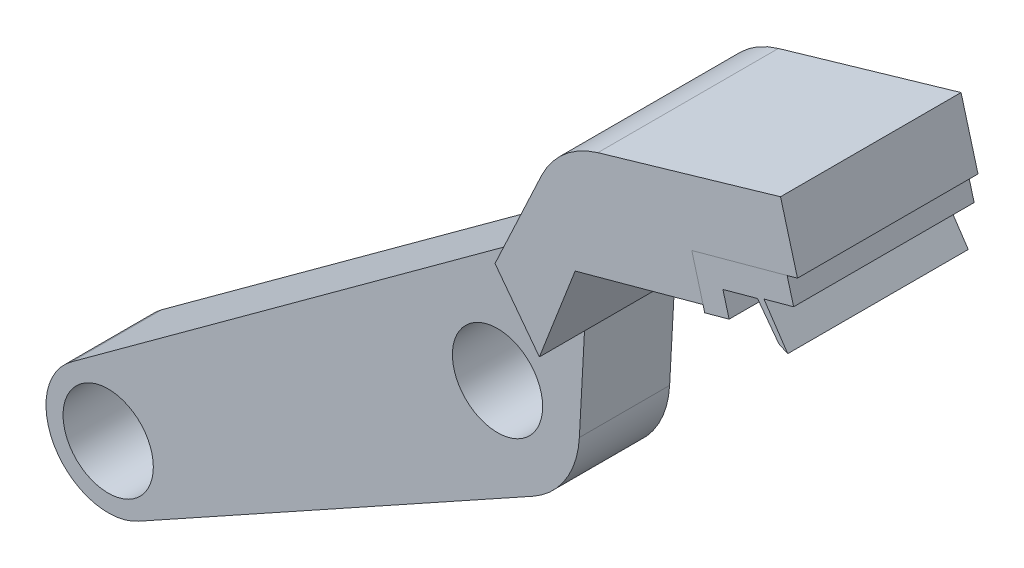
ISO-10303-21;
HEADER;
FILE_DESCRIPTION(('STEP AP214'),'2;1');
FILE_NAME('part.step','',(''),(''),'','','');
FILE_SCHEMA(('AUTOMOTIVE_DESIGN { 1 0 10303 214 1 1 1 1 }'));
ENDSEC;
DATA;
#1=APPLICATION_CONTEXT('core data for automotive mechanical design processes');
#2=APPLICATION_PROTOCOL_DEFINITION('international standard','automotive_design',2000,#1);
#3=PRODUCT_CONTEXT('',#1,'mechanical');
#4=PRODUCT('Part','Part','',(#3));
#5=PRODUCT_RELATED_PRODUCT_CATEGORY('part','',(#4));
#6=PRODUCT_DEFINITION_FORMATION('','',#4);
#7=PRODUCT_DEFINITION_CONTEXT('part definition',#1,'design');
#8=PRODUCT_DEFINITION('design','',#6,#7);
#9=PRODUCT_DEFINITION_SHAPE('','',#8);
#10=(LENGTH_UNIT() NAMED_UNIT(*) SI_UNIT(.MILLI.,.METRE.));
#11=(NAMED_UNIT(*) PLANE_ANGLE_UNIT() SI_UNIT($,.RADIAN.));
#12=(NAMED_UNIT(*) SI_UNIT($,.STERADIAN.) SOLID_ANGLE_UNIT());
#13=UNCERTAINTY_MEASURE_WITH_UNIT(LENGTH_MEASURE(1.E-05),#10,'distance_accuracy_value','');
#14=(GEOMETRIC_REPRESENTATION_CONTEXT(3) GLOBAL_UNCERTAINTY_ASSIGNED_CONTEXT((#13)) GLOBAL_UNIT_ASSIGNED_CONTEXT((#10,
#11,#12)) REPRESENTATION_CONTEXT('',''));
#15=CARTESIAN_POINT('',(0.,0.,0.));
#16=DIRECTION('',(0.,0.,1.));
#17=DIRECTION('',(1.,0.,0.));
#18=AXIS2_PLACEMENT_3D('',#15,#16,#17);
#19=CARTESIAN_POINT('',(30.6585603657704,23.7178886659538,15.));
#20=DIRECTION('',(-0.263369328323168,0.964695079752459,0.));
#21=DIRECTION('',(-0.964695079752459,-0.263369328323168,0.));
#22=AXIS2_PLACEMENT_3D('',#19,#20,#21);
#23=PLANE('',#22);
#24=DIRECTION('',(0.964695079752459,0.263369328323168,0.));
#25=VECTOR('',#24,1.);
#26=CARTESIAN_POINT('',(30.6585603657704,23.7178886659538,-5.));
#27=LINE('',#26,#25);
#28=CARTESIAN_POINT('',(27.9594920241696,22.9810218246632,-5.));
#29=VERTEX_POINT('',#28);
#30=CARTESIAN_POINT('',(30.6585603657704,23.7178886659538,-5.));
#31=VERTEX_POINT('',#30);
#32=EDGE_CURVE('E153',#29,#31,#27,.T.);
#33=ORIENTED_EDGE('',*,*,#32,.T.);
#34=DIRECTION('',(0.,0.,-1.));
#35=VECTOR('',#34,1.);
#36=CARTESIAN_POINT('',(30.6585603657704,23.7178886659538,15.));
#37=LINE('',#36,#35);
#38=CARTESIAN_POINT('',(30.6585603657704,23.7178886659538,15.));
#39=VERTEX_POINT('',#38);
#40=EDGE_CURVE('E12',#39,#31,#37,.T.);
#41=ORIENTED_EDGE('',*,*,#40,.F.);
#42=DIRECTION('',(0.964695079752459,0.263369328323168,0.));
#43=VECTOR('',#42,1.);
#44=CARTESIAN_POINT('',(30.6585603657704,23.7178886659538,15.));
#45=LINE('',#44,#43);
#46=CARTESIAN_POINT('',(27.9594920241696,22.9810218246632,15.));
#47=VERTEX_POINT('',#46);
#48=EDGE_CURVE('E171',#47,#39,#45,.T.);
#49=ORIENTED_EDGE('',*,*,#48,.F.);
#50=DIRECTION('',(0.,0.,-1.));
#51=VECTOR('',#50,1.);
#52=CARTESIAN_POINT('',(27.9594920241696,22.9810218246632,15.));
#53=LINE('',#52,#51);
#54=EDGE_CURVE('E149',#47,#29,#53,.T.);
#55=ORIENTED_EDGE('',*,*,#54,.T.);
#56=EDGE_LOOP('',(#33,#41,#49,#55));
#57=FACE_BOUND('',#56,.T.);
#58=ADVANCED_FACE('F45',(#57),#23,.F.);
#59=CARTESIAN_POINT('',(29.9720191178026,26.2326194745047,15.));
#60=DIRECTION('',(-0.964695079752459,-0.263369328323169,0.));
#61=DIRECTION('',(0.263369328323169,-0.964695079752459,0.));
#62=AXIS2_PLACEMENT_3D('',#59,#60,#61);
#63=PLANE('',#62);
#64=DIRECTION('',(-0.263369328323169,0.964695079752459,0.));
#65=VECTOR('',#64,1.);
#66=CARTESIAN_POINT('',(29.9720191178026,26.2326194745047,-5.));
#67=LINE('',#66,#65);
#68=CARTESIAN_POINT('',(29.9720191178026,26.2326194745047,-5.));
#69=VERTEX_POINT('',#68);
#70=EDGE_CURVE('E156',#31,#69,#67,.T.);
#71=ORIENTED_EDGE('',*,*,#70,.T.);
#72=DIRECTION('',(0.,0.,-1.));
#73=VECTOR('',#72,1.);
#74=CARTESIAN_POINT('',(29.9720191178026,26.2326194745047,15.));
#75=LINE('',#74,#73);
#76=CARTESIAN_POINT('',(29.9720191178026,26.2326194745047,15.));
#77=VERTEX_POINT('',#76);
#78=EDGE_CURVE('E53',#77,#69,#75,.T.);
#79=ORIENTED_EDGE('',*,*,#78,.F.);
#80=DIRECTION('',(-0.263369328323169,0.964695079752459,0.));
#81=VECTOR('',#80,1.);
#82=CARTESIAN_POINT('',(29.9720191178026,26.2326194745047,15.));
#83=LINE('',#82,#81);
#84=EDGE_CURVE('E110',#39,#77,#83,.T.);
#85=ORIENTED_EDGE('',*,*,#84,.F.);
#86=ORIENTED_EDGE('',*,*,#40,.T.);
#87=EDGE_LOOP('',(#71,#79,#85,#86));
#88=FACE_BOUND('',#87,.T.);
#89=ADVANCED_FACE('F220',(#88),#63,.F.);
#90=CARTESIAN_POINT('',(33.805939355266,27.2793097904171,15.));
#91=DIRECTION('',(-0.263369328323168,0.964695079752459,0.));
#92=DIRECTION('',(-0.964695079752459,-0.263369328323168,0.));
#93=AXIS2_PLACEMENT_3D('',#90,#91,#92);
#94=PLANE('',#93);
#95=DIRECTION('',(0.964695079752459,0.263369328323168,0.));
#96=VECTOR('',#95,1.);
#97=CARTESIAN_POINT('',(33.805939355266,27.2793097904171,-5.));
#98=LINE('',#97,#96);
#99=CARTESIAN_POINT('',(33.805939355266,27.2793097904171,-5.));
#100=VERTEX_POINT('',#99);
#101=EDGE_CURVE('E158',#69,#100,#98,.T.);
#102=ORIENTED_EDGE('',*,*,#101,.T.);
#103=DIRECTION('',(0.,0.,-1.));
#104=VECTOR('',#103,1.);
#105=CARTESIAN_POINT('',(33.805939355266,27.2793097904171,15.));
#106=LINE('',#105,#104);
#107=CARTESIAN_POINT('',(33.805939355266,27.2793097904171,15.));
#108=VERTEX_POINT('',#107);
#109=EDGE_CURVE('E184',#108,#100,#106,.T.);
#110=ORIENTED_EDGE('',*,*,#109,.F.);
#111=DIRECTION('',(0.964695079752459,0.263369328323168,0.));
#112=VECTOR('',#111,1.);
#113=CARTESIAN_POINT('',(33.805939355266,27.2793097904171,15.));
#114=LINE('',#113,#112);
#115=EDGE_CURVE('E192',#77,#108,#114,.T.);
#116=ORIENTED_EDGE('',*,*,#115,.F.);
#117=ORIENTED_EDGE('',*,*,#78,.T.);
#118=EDGE_LOOP('',(#102,#110,#116,#117));
#119=FACE_BOUND('',#118,.T.);
#120=ADVANCED_FACE('F190',(#119),#94,.F.);
#121=CARTESIAN_POINT('',(36.1643641782724,24.1145858826221,15.));
#122=DIRECTION('',(0.801834846121631,0.59754571335179,0.));
#123=DIRECTION('',(-0.59754571335179,0.801834846121631,0.));
#124=AXIS2_PLACEMENT_3D('',#121,#122,#123);
#125=PLANE('',#124);
#126=DIRECTION('',(0.59754571335179,-0.801834846121631,0.));
#127=VECTOR('',#126,1.);
#128=CARTESIAN_POINT('',(36.1643641782724,24.1145858826221,-5.));
#129=LINE('',#128,#127);
#130=CARTESIAN_POINT('',(36.1643641782724,24.1145858826221,-5.));
#131=VERTEX_POINT('',#130);
#132=EDGE_CURVE('E160',#100,#131,#129,.T.);
#133=ORIENTED_EDGE('',*,*,#132,.T.);
#134=DIRECTION('',(0.,0.,-1.));
#135=VECTOR('',#134,1.);
#136=CARTESIAN_POINT('',(36.1643641782724,24.1145858826221,15.));
#137=LINE('',#136,#135);
#138=CARTESIAN_POINT('',(36.1643641782724,24.1145858826221,15.));
#139=VERTEX_POINT('',#138);
#140=EDGE_CURVE('E181',#139,#131,#137,.T.);
#141=ORIENTED_EDGE('',*,*,#140,.F.);
#142=DIRECTION('',(0.59754571335179,-0.801834846121631,0.));
#143=VECTOR('',#142,1.);
#144=CARTESIAN_POINT('',(36.1643641782724,24.1145858826221,15.));
#145=LINE('',#144,#143);
#146=EDGE_CURVE('E210',#108,#139,#145,.T.);
#147=ORIENTED_EDGE('',*,*,#146,.F.);
#148=ORIENTED_EDGE('',*,*,#109,.T.);
#149=EDGE_LOOP('',(#133,#141,#147,#148));
#150=FACE_BOUND('',#149,.T.);
#151=ADVANCED_FACE('F201',(#150),#125,.F.);
#152=CARTESIAN_POINT('',(36.1643641782724,24.1145858826221,15.));
#153=DIRECTION('',(0.425583216728268,0.904919292334527,0.));
#154=DIRECTION('',(-0.904919292334527,0.425583216728268,0.));
#155=AXIS2_PLACEMENT_3D('',#152,#153,#154);
#156=PLANE('',#155);
#157=DIRECTION('',(0.904919292334527,-0.425583216728268,0.));
#158=VECTOR('',#157,1.);
#159=CARTESIAN_POINT('',(36.1643641782724,24.1145858826221,-5.));
#160=LINE('',#159,#158);
#161=CARTESIAN_POINT('',(37.1501654314914,23.6509639088687,-5.));
#162=VERTEX_POINT('',#161);
#163=EDGE_CURVE('E162',#131,#162,#160,.T.);
#164=ORIENTED_EDGE('',*,*,#163,.T.);
#165=DIRECTION('',(0.,0.,-1.));
#166=VECTOR('',#165,1.);
#167=CARTESIAN_POINT('',(37.1501654314914,23.6509639088687,15.));
#168=LINE('',#167,#166);
#169=CARTESIAN_POINT('',(37.1501654314914,23.6509639088687,15.));
#170=VERTEX_POINT('',#169);
#171=EDGE_CURVE('E178',#170,#162,#168,.T.);
#172=ORIENTED_EDGE('',*,*,#171,.F.);
#173=DIRECTION('',(0.904919292334527,-0.425583216728268,0.));
#174=VECTOR('',#173,1.);
#175=CARTESIAN_POINT('',(36.1643641782724,24.1145858826221,15.));
#176=LINE('',#175,#174);
#177=EDGE_CURVE('E207',#139,#170,#176,.T.);
#178=ORIENTED_EDGE('',*,*,#177,.F.);
#179=ORIENTED_EDGE('',*,*,#140,.T.);
#180=EDGE_LOOP('',(#164,#172,#178,#179));
#181=FACE_BOUND('',#180,.T.);
#182=ADVANCED_FACE('F205',(#181),#156,.F.);
#183=CARTESIAN_POINT('',(34.5167191769187,27.5854020331716,15.));
#184=DIRECTION('',(-0.831026501319877,-0.556232823648555,0.));
#185=DIRECTION('',(0.556232823648555,-0.831026501319877,0.));
#186=AXIS2_PLACEMENT_3D('',#183,#184,#185);
#187=PLANE('',#186);
#188=DIRECTION('',(-0.556232823648555,0.831026501319877,0.));
#189=VECTOR('',#188,1.);
#190=CARTESIAN_POINT('',(34.5167191769187,27.5854020331716,-5.));
#191=LINE('',#190,#189);
#192=CARTESIAN_POINT('',(34.5167191769187,27.5854020331716,-5.));
#193=VERTEX_POINT('',#192);
#194=EDGE_CURVE('E164',#162,#193,#191,.T.);
#195=ORIENTED_EDGE('',*,*,#194,.T.);
#196=DIRECTION('',(0.,0.,-1.));
#197=VECTOR('',#196,1.);
#198=CARTESIAN_POINT('',(34.5167191769187,27.5854020331716,15.));
#199=LINE('',#198,#197);
#200=CARTESIAN_POINT('',(34.5167191769187,27.5854020331716,15.));
#201=VERTEX_POINT('',#200);
#202=EDGE_CURVE('E175',#201,#193,#199,.T.);
#203=ORIENTED_EDGE('',*,*,#202,.F.);
#204=DIRECTION('',(-0.556232823648555,0.831026501319877,0.));
#205=VECTOR('',#204,1.);
#206=CARTESIAN_POINT('',(34.5167191769187,27.5854020331716,15.));
#207=LINE('',#206,#205);
#208=EDGE_CURVE('E209',#170,#201,#207,.T.);
#209=ORIENTED_EDGE('',*,*,#208,.F.);
#210=ORIENTED_EDGE('',*,*,#171,.T.);
#211=EDGE_LOOP('',(#195,#203,#209,#210));
#212=FACE_BOUND('',#211,.T.);
#213=ADVANCED_FACE('F232',(#212),#187,.F.);
#214=CARTESIAN_POINT('',(37.8052172660567,28.4831878217656,15.));
#215=DIRECTION('',(-0.263369328323169,0.964695079752459,0.));
#216=DIRECTION('',(-0.964695079752459,-0.263369328323169,0.));
#217=AXIS2_PLACEMENT_3D('',#214,#215,#216);
#218=PLANE('',#217);
#219=DIRECTION('',(0.964695079752459,0.263369328323169,0.));
#220=VECTOR('',#219,1.);
#221=CARTESIAN_POINT('',(37.8052172660567,28.4831878217656,-5.));
#222=LINE('',#221,#220);
#223=CARTESIAN_POINT('',(37.8052172660567,28.4831878217656,-5.));
#224=VERTEX_POINT('',#223);
#225=EDGE_CURVE('E166',#193,#224,#222,.T.);
#226=ORIENTED_EDGE('',*,*,#225,.T.);
#227=DIRECTION('',(0.,0.,-1.));
#228=VECTOR('',#227,1.);
#229=CARTESIAN_POINT('',(37.8052172660567,28.4831878217656,15.));
#230=LINE('',#229,#228);
#231=CARTESIAN_POINT('',(37.8052172660567,28.4831878217656,15.));
#232=VERTEX_POINT('',#231);
#233=EDGE_CURVE('E144',#232,#224,#230,.T.);
#234=ORIENTED_EDGE('',*,*,#233,.F.);
#235=DIRECTION('',(0.964695079752459,0.263369328323169,0.));
#236=VECTOR('',#235,1.);
#237=CARTESIAN_POINT('',(37.8052172660567,28.4831878217656,15.));
#238=LINE('',#237,#236);
#239=EDGE_CURVE('E135',#201,#232,#238,.T.);
#240=ORIENTED_EDGE('',*,*,#239,.F.);
#241=ORIENTED_EDGE('',*,*,#202,.T.);
#242=EDGE_LOOP('',(#226,#234,#240,#241));
#243=FACE_BOUND('',#242,.T.);
#244=ADVANCED_FACE('F235',(#243),#218,.F.);
#245=CARTESIAN_POINT('',(37.0835835166161,31.1264588962713,15.));
#246=DIRECTION('',(-0.964695079752459,-0.26336932832317,0.));
#247=DIRECTION('',(0.26336932832317,-0.964695079752459,0.));
#248=AXIS2_PLACEMENT_3D('',#245,#246,#247);
#249=PLANE('',#248);
#250=DIRECTION('',(-0.26336932832317,0.964695079752459,0.));
#251=VECTOR('',#250,1.);
#252=CARTESIAN_POINT('',(37.0835835166161,31.1264588962713,-5.));
#253=LINE('',#252,#251);
#254=CARTESIAN_POINT('',(37.0835835166161,31.1264588962713,-5.));
#255=VERTEX_POINT('',#254);
#256=EDGE_CURVE('E143',#224,#255,#253,.T.);
#257=ORIENTED_EDGE('',*,*,#256,.T.);
#258=DIRECTION('',(0.,0.,-1.));
#259=VECTOR('',#258,1.);
#260=CARTESIAN_POINT('',(37.0835835166161,31.1264588962713,15.));
#261=LINE('',#260,#259);
#262=CARTESIAN_POINT('',(37.0835835166161,31.1264588962713,15.));
#263=VERTEX_POINT('',#262);
#264=EDGE_CURVE('E140',#263,#255,#261,.T.);
#265=ORIENTED_EDGE('',*,*,#264,.F.);
#266=DIRECTION('',(-0.26336932832317,0.964695079752459,0.));
#267=VECTOR('',#266,1.);
#268=CARTESIAN_POINT('',(37.0835835166161,31.1264588962713,15.));
#269=LINE('',#268,#267);
#270=EDGE_CURVE('E129',#232,#263,#269,.T.);
#271=ORIENTED_EDGE('',*,*,#270,.F.);
#272=ORIENTED_EDGE('',*,*,#233,.T.);
#273=EDGE_LOOP('',(#257,#265,#271,#272));
#274=FACE_BOUND('',#273,.T.);
#275=ADVANCED_FACE('F141',(#274),#249,.F.);
#276=CARTESIAN_POINT('',(26.5228499427008,28.2432957431269,15.));
#277=DIRECTION('',(0.263369328323169,-0.964695079752459,0.));
#278=DIRECTION('',(0.964695079752459,0.263369328323169,0.));
#279=AXIS2_PLACEMENT_3D('',#276,#277,#278);
#280=PLANE('',#279);
#281=DIRECTION('',(-0.964695079752459,-0.263369328323169,0.));
#282=VECTOR('',#281,1.);
#283=CARTESIAN_POINT('',(26.5228499427008,28.2432957431269,-5.));
#284=LINE('',#283,#282);
#285=CARTESIAN_POINT('',(26.5228499427008,28.2432957431269,-5.));
#286=VERTEX_POINT('',#285);
#287=EDGE_CURVE('E96',#255,#286,#284,.T.);
#288=ORIENTED_EDGE('',*,*,#287,.T.);
#289=DIRECTION('',(0.,0.,-1.));
#290=VECTOR('',#289,1.);
#291=CARTESIAN_POINT('',(26.5228499427008,28.2432957431269,15.));
#292=LINE('',#291,#290);
#293=CARTESIAN_POINT('',(26.5228499427008,28.2432957431269,15.));
#294=VERTEX_POINT('',#293);
#295=EDGE_CURVE('E145',#294,#286,#292,.T.);
#296=ORIENTED_EDGE('',*,*,#295,.F.);
#297=DIRECTION('',(-0.964695079752459,-0.263369328323169,0.));
#298=VECTOR('',#297,1.);
#299=CARTESIAN_POINT('',(26.5228499427008,28.2432957431269,15.));
#300=LINE('',#299,#298);
#301=EDGE_CURVE('E133',#263,#294,#300,.T.);
#302=ORIENTED_EDGE('',*,*,#301,.F.);
#303=ORIENTED_EDGE('',*,*,#264,.T.);
#304=EDGE_LOOP('',(#288,#296,#302,#303));
#305=FACE_BOUND('',#304,.T.);
#306=ADVANCED_FACE('F147',(#305),#280,.F.);
#307=CARTESIAN_POINT('',(27.9594920241696,22.9810218246632,15.));
#308=DIRECTION('',(0.964695079752459,0.263369328323169,0.));
#309=DIRECTION('',(-0.263369328323169,0.964695079752459,0.));
#310=AXIS2_PLACEMENT_3D('',#307,#308,#309);
#311=PLANE('',#310);
#312=DIRECTION('',(0.263369328323169,-0.964695079752459,0.));
#313=VECTOR('',#312,1.);
#314=CARTESIAN_POINT('',(27.9594920241696,22.9810218246632,-5.));
#315=LINE('',#314,#313);
#316=EDGE_CURVE('E102',#286,#29,#315,.T.);
#317=ORIENTED_EDGE('',*,*,#316,.T.);
#318=ORIENTED_EDGE('',*,*,#54,.F.);
#319=DIRECTION('',(0.263369328323169,-0.964695079752459,0.));
#320=VECTOR('',#319,1.);
#321=CARTESIAN_POINT('',(27.9594920241696,22.9810218246632,15.));
#322=LINE('',#321,#320);
#323=EDGE_CURVE('E61',#294,#47,#322,.T.);
#324=ORIENTED_EDGE('',*,*,#323,.F.);
#325=ORIENTED_EDGE('',*,*,#295,.T.);
#326=EDGE_LOOP('',(#317,#318,#324,#325));
#327=FACE_BOUND('',#326,.T.);
#328=ADVANCED_FACE('F244',(#327),#311,.F.);
#329=CARTESIAN_POINT('',(27.9594920241696,22.9810218246632,15.));
#330=DIRECTION('',(0.,0.,-1.));
#331=DIRECTION('',(-1.,0.,0.));
#332=AXIS2_PLACEMENT_3D('',#329,#330,#331);
#333=PLANE('',#332);
#334=ORIENTED_EDGE('',*,*,#48,.T.);
#335=ORIENTED_EDGE('',*,*,#84,.T.);
#336=ORIENTED_EDGE('',*,*,#115,.T.);
#337=ORIENTED_EDGE('',*,*,#146,.T.);
#338=ORIENTED_EDGE('',*,*,#177,.T.);
#339=ORIENTED_EDGE('',*,*,#208,.T.);
#340=ORIENTED_EDGE('',*,*,#239,.T.);
#341=ORIENTED_EDGE('',*,*,#270,.T.);
#342=ORIENTED_EDGE('',*,*,#301,.T.);
#343=ORIENTED_EDGE('',*,*,#323,.T.);
#344=EDGE_LOOP('',(#334,#335,#336,#337,#338,#339,#340,#341,#342,#343));
#345=FACE_BOUND('',#344,.T.);
#346=ADVANCED_FACE('F131',(#345),#333,.F.);
#347=CARTESIAN_POINT('',(27.9594920241696,22.9810218246632,-5.));
#348=DIRECTION('',(0.,0.,-1.));
#349=DIRECTION('',(-1.,0.,0.));
#350=AXIS2_PLACEMENT_3D('',#347,#348,#349);
#351=PLANE('',#350);
#352=ORIENTED_EDGE('',*,*,#32,.F.);
#353=ORIENTED_EDGE('',*,*,#316,.F.);
#354=ORIENTED_EDGE('',*,*,#287,.F.);
#355=ORIENTED_EDGE('',*,*,#256,.F.);
#356=ORIENTED_EDGE('',*,*,#225,.F.);
#357=ORIENTED_EDGE('',*,*,#194,.F.);
#358=ORIENTED_EDGE('',*,*,#163,.F.);
#359=ORIENTED_EDGE('',*,*,#132,.F.);
#360=ORIENTED_EDGE('',*,*,#101,.F.);
#361=ORIENTED_EDGE('',*,*,#70,.F.);
#362=EDGE_LOOP('',(#352,#353,#354,#355,#356,#357,#358,#359,#360,#361));
#363=FACE_BOUND('',#362,.T.);
#364=ADVANCED_FACE('F196',(#363),#351,.T.);
#365=CLOSED_SHELL('',(#58,#89,#120,#151,#182,#213,#244,#275,#306,#328,#346,#364));
#366=MANIFOLD_SOLID_BREP('B2',#365);
#367=CARTESIAN_POINT('',(-43.1307200556563,-27.3635895468551,10.));
#368=DIRECTION('',(0.,0.,1.));
#369=DIRECTION('',(1.,0.,0.));
#370=AXIS2_PLACEMENT_3D('',#367,#368,#369);
#371=PLANE('',#370);
#372=CARTESIAN_POINT('',(-43.1307200556563,-27.3635895468551,10.));
#373=DIRECTION('',(0.,0.,1.));
#374=DIRECTION('',(1.,0.,0.));
#375=AXIS2_PLACEMENT_3D('',#372,#373,#374);
#376=CIRCLE('',#375,5.);
#377=CARTESIAN_POINT('',(-38.1307200556563,-27.3635895468551,10.));
#378=VERTEX_POINT('',#377);
#379=EDGE_CURVE('E664',#378,#378,#376,.T.);
#380=ORIENTED_EDGE('',*,*,#379,.F.);
#381=EDGE_LOOP('',(#380));
#382=FACE_BOUND('',#381,.T.);
#383=CARTESIAN_POINT('',(0.,0.,10.));
#384=DIRECTION('',(0.,0.,1.));
#385=DIRECTION('',(1.,0.,0.));
#386=AXIS2_PLACEMENT_3D('',#383,#384,#385);
#387=CIRCLE('',#386,5.);
#388=CARTESIAN_POINT('',(5.,0.,10.));
#389=VERTEX_POINT('',#388);
#390=EDGE_CURVE('E659',#389,#389,#387,.T.);
#391=ORIENTED_EDGE('',*,*,#390,.F.);
#392=EDGE_LOOP('',(#391));
#393=FACE_BOUND('',#392,.T.);
#394=DIRECTION('',(0.0541478021752927,0.998532931614969,0.));
#395=VECTOR('',#394,1.);
#396=CARTESIAN_POINT('',(9.06744571504533,-0.928465661816441,10.));
#397=LINE('',#396,#395);
#398=CARTESIAN_POINT('',(9.06744571504533,-0.928465661816447,10.));
#399=VERTEX_POINT('',#398);
#400=CARTESIAN_POINT('',(9.63756314314747,9.58499940929917,10.));
#401=VERTEX_POINT('',#400);
#402=EDGE_CURVE('E672',#399,#401,#397,.T.);
#403=ORIENTED_EDGE('',*,*,#402,.T.);
#404=DIRECTION('',(-0.602424274355772,0.798176041777077,0.));
#405=VECTOR('',#404,1.);
#406=CARTESIAN_POINT('',(8.25354383622917,11.4187420042842,10.));
#407=LINE('',#406,#405);
#408=CARTESIAN_POINT('',(4.72353928340557,16.0957863754475,10.));
#409=VERTEX_POINT('',#408);
#410=EDGE_CURVE('E459',#401,#409,#407,.T.);
#411=ORIENTED_EDGE('',*,*,#410,.T.);
#412=DIRECTION('',(-0.807739245129829,-0.589539915423115,0.));
#413=VECTOR('',#412,1.);
#414=CARTESIAN_POINT('',(10.2076805712496,20.0984644804148,10.));
#415=LINE('',#414,#413);
#416=CARTESIAN_POINT('',(-47.1937392466819,-21.7967738513451,10.));
#417=VERTEX_POINT('',#416);
#418=EDGE_CURVE('E556',#409,#417,#415,.T.);
#419=ORIENTED_EDGE('',*,*,#418,.T.);
#420=CARTESIAN_POINT('',(-43.1307200556563,-27.3635895468551,10.));
#421=DIRECTION('',(0.,0.,1.));
#422=DIRECTION('',(1.,0.,0.));
#423=AXIS2_PLACEMENT_3D('',#420,#421,#422);
#424=CIRCLE('',#423,6.89184749790783);
#425=CARTESIAN_POINT('',(-39.7869636215944,-33.3899362713714,10.));
#426=VERTEX_POINT('',#425);
#427=EDGE_CURVE('E676',#417,#426,#424,.T.);
#428=ORIENTED_EDGE('',*,*,#427,.T.);
#429=DIRECTION('',(0.874416725899069,0.485175627446344,0.));
#430=VECTOR('',#429,1.);
#431=CARTESIAN_POINT('',(-39.7869636215944,-33.3899362713714,10.));
#432=LINE('',#431,#430);
#433=CARTESIAN_POINT('',(3.93387267335906,-9.1311548990542,10.));
#434=VERTEX_POINT('',#433);
#435=EDGE_CURVE('E678',#426,#434,#432,.T.);
#436=ORIENTED_EDGE('',*,*,#435,.T.);
#437=CARTESIAN_POINT('',(-0.917883601104367,-0.386987640063513,10.));
#438=DIRECTION('',(0.,0.,1.));
#439=DIRECTION('',(1.,0.,0.));
#440=AXIS2_PLACEMENT_3D('',#437,#438,#439);
#441=CIRCLE('',#440,10.);
#442=EDGE_CURVE('E680',#434,#399,#441,.T.);
#443=ORIENTED_EDGE('',*,*,#442,.T.);
#444=EDGE_LOOP('',(#403,#411,#419,#428,#436,#443));
#445=FACE_BOUND('',#444,.T.);
#446=ADVANCED_FACE('F325',(#382,#393,#445),#371,.T.);
#447=CARTESIAN_POINT('',(-43.1307200556563,-27.3635895468551,0.));
#448=DIRECTION('',(0.,0.,1.));
#449=DIRECTION('',(1.,0.,0.));
#450=AXIS2_PLACEMENT_3D('',#447,#448,#449);
#451=PLANE('',#450);
#452=CARTESIAN_POINT('',(-43.1307200556563,-27.3635895468551,0.));
#453=DIRECTION('',(0.,0.,1.));
#454=DIRECTION('',(1.,0.,0.));
#455=AXIS2_PLACEMENT_3D('',#452,#453,#454);
#456=CIRCLE('',#455,5.);
#457=CARTESIAN_POINT('',(-38.1307200556563,-27.3635895468551,0.));
#458=VERTEX_POINT('',#457);
#459=EDGE_CURVE('E668',#458,#458,#456,.T.);
#460=ORIENTED_EDGE('',*,*,#459,.T.);
#461=EDGE_LOOP('',(#460));
#462=FACE_BOUND('',#461,.T.);
#463=CARTESIAN_POINT('',(0.,0.,0.));
#464=DIRECTION('',(0.,0.,1.));
#465=DIRECTION('',(1.,0.,0.));
#466=AXIS2_PLACEMENT_3D('',#463,#464,#465);
#467=CIRCLE('',#466,5.);
#468=CARTESIAN_POINT('',(5.,0.,0.));
#469=VERTEX_POINT('',#468);
#470=EDGE_CURVE('E662',#469,#469,#467,.T.);
#471=ORIENTED_EDGE('',*,*,#470,.T.);
#472=EDGE_LOOP('',(#471));
#473=FACE_BOUND('',#472,.T.);
#474=DIRECTION('',(-0.602424274355772,0.798176041777077,0.));
#475=VECTOR('',#474,1.);
#476=CARTESIAN_POINT('',(8.25354383622917,11.4187420042842,0.));
#477=LINE('',#476,#475);
#478=CARTESIAN_POINT('',(9.63756314314747,9.58499940929917,0.));
#479=VERTEX_POINT('',#478);
#480=CARTESIAN_POINT('',(4.72353928340557,16.0957863754475,0.));
#481=VERTEX_POINT('',#480);
#482=EDGE_CURVE('E348',#479,#481,#477,.T.);
#483=ORIENTED_EDGE('',*,*,#482,.F.);
#484=DIRECTION('',(0.0541478021752927,0.998532931614969,0.));
#485=VECTOR('',#484,1.);
#486=CARTESIAN_POINT('',(9.06744571504533,-0.928465661816441,0.));
#487=LINE('',#486,#485);
#488=CARTESIAN_POINT('',(9.06744571504533,-0.928465661816447,0.));
#489=VERTEX_POINT('',#488);
#490=EDGE_CURVE('E561',#489,#479,#487,.T.);
#491=ORIENTED_EDGE('',*,*,#490,.F.);
#492=CARTESIAN_POINT('',(-0.917883601104367,-0.386987640063513,0.));
#493=DIRECTION('',(0.,0.,1.));
#494=DIRECTION('',(1.,0.,0.));
#495=AXIS2_PLACEMENT_3D('',#492,#493,#494);
#496=CIRCLE('',#495,10.);
#497=CARTESIAN_POINT('',(3.93387267335906,-9.1311548990542,0.));
#498=VERTEX_POINT('',#497);
#499=EDGE_CURVE('E674',#498,#489,#496,.T.);
#500=ORIENTED_EDGE('',*,*,#499,.F.);
#501=DIRECTION('',(0.874416725899069,0.485175627446344,0.));
#502=VECTOR('',#501,1.);
#503=CARTESIAN_POINT('',(-39.7869636215944,-33.3899362713714,0.));
#504=LINE('',#503,#502);
#505=CARTESIAN_POINT('',(-39.7869636215944,-33.3899362713714,0.));
#506=VERTEX_POINT('',#505);
#507=EDGE_CURVE('E685',#506,#498,#504,.T.);
#508=ORIENTED_EDGE('',*,*,#507,.F.);
#509=CARTESIAN_POINT('',(-43.1307200556563,-27.3635895468551,0.));
#510=DIRECTION('',(0.,0.,1.));
#511=DIRECTION('',(1.,0.,0.));
#512=AXIS2_PLACEMENT_3D('',#509,#510,#511);
#513=CIRCLE('',#512,6.89184749790783);
#514=CARTESIAN_POINT('',(-47.1937392466819,-21.7967738513451,0.));
#515=VERTEX_POINT('',#514);
#516=EDGE_CURVE('E560',#515,#506,#513,.T.);
#517=ORIENTED_EDGE('',*,*,#516,.F.);
#518=DIRECTION('',(-0.807739245129829,-0.589539915423115,0.));
#519=VECTOR('',#518,1.);
#520=CARTESIAN_POINT('',(10.2076805712496,20.0984644804148,0.));
#521=LINE('',#520,#519);
#522=EDGE_CURVE('E554',#481,#515,#521,.T.);
#523=ORIENTED_EDGE('',*,*,#522,.F.);
#524=EDGE_LOOP('',(#483,#491,#500,#508,#517,#523));
#525=FACE_BOUND('',#524,.T.);
#526=ADVANCED_FACE('F558',(#462,#473,#525),#451,.F.);
#527=CARTESIAN_POINT('',(9.06744571504533,-0.928465661816441,10.));
#528=DIRECTION('',(-0.998532931614969,0.0541478021752927,0.));
#529=DIRECTION('',(-0.0541478021752927,-0.998532931614969,0.));
#530=AXIS2_PLACEMENT_3D('',#527,#528,#529);
#531=PLANE('',#530);
#532=DIRECTION('',(0.,0.,-1.));
#533=VECTOR('',#532,1.);
#534=CARTESIAN_POINT('',(9.63756314314747,9.58499940929917,15.));
#535=LINE('',#534,#533);
#536=EDGE_CURVE('E340',#401,#479,#535,.T.);
#537=ORIENTED_EDGE('',*,*,#536,.F.);
#538=ORIENTED_EDGE('',*,*,#402,.F.);
#539=DIRECTION('',(0.,0.,-1.));
#540=VECTOR('',#539,1.);
#541=CARTESIAN_POINT('',(9.06744571504533,-0.928465661816447,10.));
#542=LINE('',#541,#540);
#543=EDGE_CURVE('E682',#399,#489,#542,.T.);
#544=ORIENTED_EDGE('',*,*,#543,.T.);
#545=ORIENTED_EDGE('',*,*,#490,.T.);
#546=EDGE_LOOP('',(#537,#538,#544,#545));
#547=FACE_BOUND('',#546,.T.);
#548=ADVANCED_FACE('F327',(#547),#531,.F.);
#549=CARTESIAN_POINT('',(10.2076805712496,20.0984644804148,10.));
#550=DIRECTION('',(0.589539915423115,-0.807739245129829,0.));
#551=DIRECTION('',(0.80773924512983,0.589539915423115,0.));
#552=AXIS2_PLACEMENT_3D('',#549,#550,#551);
#553=PLANE('',#552);
#554=DIRECTION('',(0.,0.,1.));
#555=VECTOR('',#554,1.);
#556=CARTESIAN_POINT('',(4.72353928340556,16.0957863754475,10.));
#557=LINE('',#556,#555);
#558=EDGE_CURVE('E43',#481,#409,#557,.T.);
#559=ORIENTED_EDGE('',*,*,#558,.F.);
#560=ORIENTED_EDGE('',*,*,#522,.T.);
#561=DIRECTION('',(0.,0.,-1.));
#562=VECTOR('',#561,1.);
#563=CARTESIAN_POINT('',(-47.1937392466819,-21.7967738513451,10.));
#564=LINE('',#563,#562);
#565=EDGE_CURVE('E333',#417,#515,#564,.T.);
#566=ORIENTED_EDGE('',*,*,#565,.F.);
#567=ORIENTED_EDGE('',*,*,#418,.F.);
#568=EDGE_LOOP('',(#559,#560,#566,#567));
#569=FACE_BOUND('',#568,.T.);
#570=ADVANCED_FACE('F552',(#569),#553,.F.);
#571=CARTESIAN_POINT('',(-43.1307200556563,-27.3635895468551,10.));
#572=DIRECTION('',(0.,0.,-1.));
#573=DIRECTION('',(-1.,0.,0.));
#574=AXIS2_PLACEMENT_3D('',#571,#572,#573);
#575=CYLINDRICAL_SURFACE('',#574,6.89184749790783);
#576=ORIENTED_EDGE('',*,*,#516,.T.);
#577=DIRECTION('',(0.,0.,-1.));
#578=VECTOR('',#577,1.);
#579=CARTESIAN_POINT('',(-39.7869636215944,-33.3899362713714,10.));
#580=LINE('',#579,#578);
#581=EDGE_CURVE('E693',#426,#506,#580,.T.);
#582=ORIENTED_EDGE('',*,*,#581,.F.);
#583=ORIENTED_EDGE('',*,*,#427,.F.);
#584=ORIENTED_EDGE('',*,*,#565,.T.);
#585=EDGE_LOOP('',(#576,#582,#583,#584));
#586=FACE_BOUND('',#585,.T.);
#587=ADVANCED_FACE('F596',(#586),#575,.T.);
#588=CARTESIAN_POINT('',(-39.7869636215944,-33.3899362713714,10.));
#589=DIRECTION('',(-0.485175627446344,0.874416725899069,0.));
#590=DIRECTION('',(-0.874416725899069,-0.485175627446344,0.));
#591=AXIS2_PLACEMENT_3D('',#588,#589,#590);
#592=PLANE('',#591);
#593=ORIENTED_EDGE('',*,*,#507,.T.);
#594=DIRECTION('',(0.,0.,-1.));
#595=VECTOR('',#594,1.);
#596=CARTESIAN_POINT('',(3.93387267335906,-9.1311548990542,10.));
#597=LINE('',#596,#595);
#598=EDGE_CURVE('E690',#434,#498,#597,.T.);
#599=ORIENTED_EDGE('',*,*,#598,.F.);
#600=ORIENTED_EDGE('',*,*,#435,.F.);
#601=ORIENTED_EDGE('',*,*,#581,.T.);
#602=EDGE_LOOP('',(#593,#599,#600,#601));
#603=FACE_BOUND('',#602,.T.);
#604=ADVANCED_FACE('F592',(#603),#592,.F.);
#605=CARTESIAN_POINT('',(-0.917883601104367,-0.386987640063513,10.));
#606=DIRECTION('',(0.,0.,-1.));
#607=DIRECTION('',(-1.,0.,0.));
#608=AXIS2_PLACEMENT_3D('',#605,#606,#607);
#609=CYLINDRICAL_SURFACE('',#608,10.);
#610=ORIENTED_EDGE('',*,*,#499,.T.);
#611=ORIENTED_EDGE('',*,*,#543,.F.);
#612=ORIENTED_EDGE('',*,*,#442,.F.);
#613=ORIENTED_EDGE('',*,*,#598,.T.);
#614=EDGE_LOOP('',(#610,#611,#612,#613));
#615=FACE_BOUND('',#614,.T.);
#616=ADVANCED_FACE('F589',(#615),#609,.T.);
#617=CARTESIAN_POINT('',(0.,0.,10.));
#618=DIRECTION('',(0.,0.,-1.));
#619=DIRECTION('',(-1.,0.,0.));
#620=AXIS2_PLACEMENT_3D('',#617,#618,#619);
#621=CYLINDRICAL_SURFACE('',#620,5.);
#622=ORIENTED_EDGE('',*,*,#390,.T.);
#623=EDGE_LOOP('',(#622));
#624=FACE_BOUND('',#623,.T.);
#625=ORIENTED_EDGE('',*,*,#470,.F.);
#626=EDGE_LOOP('',(#625));
#627=FACE_BOUND('',#626,.T.);
#628=ADVANCED_FACE('F586',(#624,#627),#621,.F.);
#629=CARTESIAN_POINT('',(-43.1307200556563,-27.3635895468551,10.));
#630=DIRECTION('',(0.,0.,-1.));
#631=DIRECTION('',(-1.,0.,0.));
#632=AXIS2_PLACEMENT_3D('',#629,#630,#631);
#633=CYLINDRICAL_SURFACE('',#632,5.);
#634=ORIENTED_EDGE('',*,*,#379,.T.);
#635=EDGE_LOOP('',(#634));
#636=FACE_BOUND('',#635,.T.);
#637=ORIENTED_EDGE('',*,*,#459,.F.);
#638=EDGE_LOOP('',(#637));
#639=FACE_BOUND('',#638,.T.);
#640=ADVANCED_FACE('F620',(#636,#639),#633,.F.);
#641=CARTESIAN_POINT('',(4.72353928340557,16.0957863754475,15.));
#642=DIRECTION('',(0.798176041777077,0.602424274355772,0.));
#643=DIRECTION('',(-0.602424274355772,0.798176041777077,0.));
#644=AXIS2_PLACEMENT_3D('',#641,#642,#643);
#645=PLANE('',#644);
#646=CARTESIAN_POINT('',(9.63756314314747,9.58499940929917,-5.));
#647=VERTEX_POINT('',#646);
#648=EDGE_CURVE('E461',#479,#647,#535,.T.);
#649=ORIENTED_EDGE('',*,*,#648,.F.);
#650=ORIENTED_EDGE('',*,*,#482,.T.);
#651=DIRECTION('',(0.,0.,-1.));
#652=VECTOR('',#651,1.);
#653=CARTESIAN_POINT('',(4.72353928340557,16.0957863754475,15.));
#654=LINE('',#653,#652);
#655=CARTESIAN_POINT('',(4.72353928340557,16.0957863754475,-5.));
#656=VERTEX_POINT('',#655);
#657=EDGE_CURVE('E489',#481,#656,#654,.T.);
#658=ORIENTED_EDGE('',*,*,#657,.T.);
#659=DIRECTION('',(0.602424274355772,-0.798176041777077,0.));
#660=VECTOR('',#659,1.);
#661=CARTESIAN_POINT('',(4.72353928340557,16.0957863754475,-5.));
#662=LINE('',#661,#660);
#663=EDGE_CURVE('E506',#656,#647,#662,.T.);
#664=ORIENTED_EDGE('',*,*,#663,.T.);
#665=EDGE_LOOP('',(#649,#650,#658,#664));
#666=FACE_BOUND('',#665,.T.);
#667=ADVANCED_FACE('F564',(#666),#645,.F.);
#668=ORIENTED_EDGE('',*,*,#410,.F.);
#669=CARTESIAN_POINT('',(9.63756314314747,9.58499940929917,15.));
#670=VERTEX_POINT('',#669);
#671=EDGE_CURVE('E439',#670,#401,#535,.T.);
#672=ORIENTED_EDGE('',*,*,#671,.F.);
#673=DIRECTION('',(0.602424274355772,-0.798176041777077,0.));
#674=VECTOR('',#673,1.);
#675=CARTESIAN_POINT('',(4.72353928340557,16.0957863754475,15.));
#676=LINE('',#675,#674);
#677=CARTESIAN_POINT('',(4.72353928340557,16.0957863754475,15.));
#678=VERTEX_POINT('',#677);
#679=EDGE_CURVE('E445',#678,#670,#676,.T.);
#680=ORIENTED_EDGE('',*,*,#679,.F.);
#681=EDGE_CURVE('E487',#678,#409,#654,.T.);
#682=ORIENTED_EDGE('',*,*,#681,.T.);
#683=EDGE_LOOP('',(#668,#672,#680,#682));
#684=FACE_BOUND('',#683,.T.);
#685=ADVANCED_FACE('F457',(#684),#645,.F.);
#686=CARTESIAN_POINT('',(9.63756314314747,9.58499940929917,15.));
#687=DIRECTION('',(-0.932398288387163,0.361432471995377,0.));
#688=DIRECTION('',(-0.361432471995377,-0.932398288387163,0.));
#689=AXIS2_PLACEMENT_3D('',#686,#687,#688);
#690=PLANE('',#689);
#691=DIRECTION('',(0.361432471995377,0.932398288387163,0.));
#692=VECTOR('',#691,1.);
#693=CARTESIAN_POINT('',(9.63756314314747,9.58499940929917,-5.));
#694=LINE('',#693,#692);
#695=CARTESIAN_POINT('',(13.6021824204714,19.8126477660601,-5.));
#696=VERTEX_POINT('',#695);
#697=EDGE_CURVE('E504',#647,#696,#694,.T.);
#698=ORIENTED_EDGE('',*,*,#697,.T.);
#699=DIRECTION('',(0.,0.,-1.));
#700=VECTOR('',#699,1.);
#701=CARTESIAN_POINT('',(13.6021824204714,19.8126477660601,15.));
#702=LINE('',#701,#700);
#703=CARTESIAN_POINT('',(13.6021824204714,19.8126477660601,15.));
#704=VERTEX_POINT('',#703);
#705=EDGE_CURVE('E441',#704,#696,#702,.T.);
#706=ORIENTED_EDGE('',*,*,#705,.F.);
#707=DIRECTION('',(0.361432471995377,0.932398288387163,0.));
#708=VECTOR('',#707,1.);
#709=CARTESIAN_POINT('',(9.63756314314747,9.58499940929917,15.));
#710=LINE('',#709,#708);
#711=EDGE_CURVE('E435',#670,#704,#710,.T.);
#712=ORIENTED_EDGE('',*,*,#711,.F.);
#713=ORIENTED_EDGE('',*,*,#671,.T.);
#714=ORIENTED_EDGE('',*,*,#536,.T.);
#715=ORIENTED_EDGE('',*,*,#648,.T.);
#716=EDGE_LOOP('',(#698,#706,#712,#713,#714,#715));
#717=FACE_BOUND('',#716,.T.);
#718=ADVANCED_FACE('F437',(#717),#690,.F.);
#719=CARTESIAN_POINT('',(13.6021824204714,19.8126477660601,15.));
#720=DIRECTION('',(-0.263369328323168,0.964695079752459,0.));
#721=DIRECTION('',(-0.964695079752459,-0.263369328323168,0.));
#722=AXIS2_PLACEMENT_3D('',#719,#720,#721);
#723=PLANE('',#722);
#724=DIRECTION('',(0.964695079752459,0.263369328323168,0.));
#725=VECTOR('',#724,1.);
#726=CARTESIAN_POINT('',(13.6021824204714,19.8126477660601,-5.));
#727=LINE('',#726,#725);
#728=CARTESIAN_POINT('',(27.768612437721,23.6801943480719,-5.));
#729=VERTEX_POINT('',#728);
#730=EDGE_CURVE('E502',#696,#729,#727,.T.);
#731=ORIENTED_EDGE('',*,*,#730,.T.);
#732=DIRECTION('',(0.,0.,-1.));
#733=VECTOR('',#732,1.);
#734=CARTESIAN_POINT('',(27.768612437721,23.6801943480719,15.));
#735=LINE('',#734,#733);
#736=CARTESIAN_POINT('',(27.768612437721,23.6801943480719,15.));
#737=VERTEX_POINT('',#736);
#738=EDGE_CURVE('E466',#737,#729,#735,.T.);
#739=ORIENTED_EDGE('',*,*,#738,.F.);
#740=DIRECTION('',(0.964695079752459,0.263369328323168,0.));
#741=VECTOR('',#740,1.);
#742=CARTESIAN_POINT('',(13.6021824204714,19.8126477660601,15.));
#743=LINE('',#742,#741);
#744=EDGE_CURVE('E444',#704,#737,#743,.T.);
#745=ORIENTED_EDGE('',*,*,#744,.F.);
#746=ORIENTED_EDGE('',*,*,#705,.T.);
#747=EDGE_LOOP('',(#731,#739,#745,#746));
#748=FACE_BOUND('',#747,.T.);
#749=ADVANCED_FACE('F523',(#748),#723,.F.);
#750=CARTESIAN_POINT('',(27.768612437721,23.6801943480719,15.));
#751=DIRECTION('',(-0.964695079752459,-0.263369328323168,0.));
#752=DIRECTION('',(0.263369328323168,-0.964695079752459,0.));
#753=AXIS2_PLACEMENT_3D('',#750,#751,#752);
#754=PLANE('',#753);
#755=DIRECTION('',(-0.263369328323168,0.964695079752459,0.));
#756=VECTOR('',#755,1.);
#757=CARTESIAN_POINT('',(27.768612437721,23.6801943480719,-5.));
#758=LINE('',#757,#756);
#759=CARTESIAN_POINT('',(26.5228499427008,28.2432957431269,-5.));
#760=VERTEX_POINT('',#759);
#761=EDGE_CURVE('E500',#729,#760,#758,.T.);
#762=ORIENTED_EDGE('',*,*,#761,.T.);
#763=DIRECTION('',(0.,0.,-1.));
#764=VECTOR('',#763,1.);
#765=CARTESIAN_POINT('',(26.5228499427008,28.2432957431269,15.));
#766=LINE('',#765,#764);
#767=CARTESIAN_POINT('',(26.5228499427008,28.2432957431269,15.));
#768=VERTEX_POINT('',#767);
#769=EDGE_CURVE('E470',#768,#760,#766,.T.);
#770=ORIENTED_EDGE('',*,*,#769,.F.);
#771=DIRECTION('',(-0.263369328323168,0.964695079752459,0.));
#772=VECTOR('',#771,1.);
#773=CARTESIAN_POINT('',(27.768612437721,23.6801943480719,15.));
#774=LINE('',#773,#772);
#775=EDGE_CURVE('E518',#737,#768,#774,.T.);
#776=ORIENTED_EDGE('',*,*,#775,.F.);
#777=ORIENTED_EDGE('',*,*,#738,.T.);
#778=EDGE_LOOP('',(#762,#770,#776,#777));
#779=FACE_BOUND('',#778,.T.);
#780=ADVANCED_FACE('F526',(#779),#754,.F.);
#781=CARTESIAN_POINT('',(26.5228499427008,28.2432957431269,15.));
#782=DIRECTION('',(-0.263369328323169,0.964695079752459,0.));
#783=DIRECTION('',(-0.964695079752459,-0.263369328323169,0.));
#784=AXIS2_PLACEMENT_3D('',#781,#782,#783);
#785=PLANE('',#784);
#786=DIRECTION('',(0.964695079752459,0.263369328323169,0.));
#787=VECTOR('',#786,1.);
#788=CARTESIAN_POINT('',(26.5228499427008,28.2432957431269,-5.));
#789=LINE('',#788,#787);
#790=CARTESIAN_POINT('',(38.23040148952,31.439549203843,-5.));
#791=VERTEX_POINT('',#790);
#792=EDGE_CURVE('E498',#760,#791,#789,.T.);
#793=ORIENTED_EDGE('',*,*,#792,.T.);
#794=DIRECTION('',(0.,0.,-1.));
#795=VECTOR('',#794,1.);
#796=CARTESIAN_POINT('',(38.23040148952,31.439549203843,15.));
#797=LINE('',#796,#795);
#798=CARTESIAN_POINT('',(38.23040148952,31.439549203843,15.));
#799=VERTEX_POINT('',#798);
#800=EDGE_CURVE('E475',#799,#791,#797,.T.);
#801=ORIENTED_EDGE('',*,*,#800,.F.);
#802=DIRECTION('',(0.964695079752459,0.263369328323169,0.));
#803=VECTOR('',#802,1.);
#804=CARTESIAN_POINT('',(26.5228499427008,28.2432957431269,15.));
#805=LINE('',#804,#803);
#806=EDGE_CURVE('E516',#768,#799,#805,.T.);
#807=ORIENTED_EDGE('',*,*,#806,.F.);
#808=ORIENTED_EDGE('',*,*,#769,.T.);
#809=EDGE_LOOP('',(#793,#801,#807,#808));
#810=FACE_BOUND('',#809,.T.);
#811=ADVANCED_FACE('F531',(#810),#785,.F.);
#812=CARTESIAN_POINT('',(38.23040148952,31.439549203843,15.));
#813=DIRECTION('',(-0.964695079752459,-0.263369328323168,0.));
#814=DIRECTION('',(0.263369328323168,-0.964695079752459,0.));
#815=AXIS2_PLACEMENT_3D('',#812,#813,#814);
#816=PLANE('',#815);
#817=DIRECTION('',(-0.263369328323168,0.964695079752459,0.));
#818=VECTOR('',#817,1.);
#819=CARTESIAN_POINT('',(38.23040148952,31.439549203843,-5.));
#820=LINE('',#819,#818);
#821=CARTESIAN_POINT('',(36.3535815811306,38.3141497609095,-5.));
#822=VERTEX_POINT('',#821);
#823=EDGE_CURVE('E496',#791,#822,#820,.T.);
#824=ORIENTED_EDGE('',*,*,#823,.T.);
#825=DIRECTION('',(0.,0.,-1.));
#826=VECTOR('',#825,1.);
#827=CARTESIAN_POINT('',(36.3535815811306,38.3141497609095,15.));
#828=LINE('',#827,#826);
#829=CARTESIAN_POINT('',(36.3535815811306,38.3141497609095,15.));
#830=VERTEX_POINT('',#829);
#831=EDGE_CURVE('E478',#830,#822,#828,.T.);
#832=ORIENTED_EDGE('',*,*,#831,.F.);
#833=DIRECTION('',(-0.263369328323168,0.964695079752459,0.));
#834=VECTOR('',#833,1.);
#835=CARTESIAN_POINT('',(38.23040148952,31.439549203843,15.));
#836=LINE('',#835,#834);
#837=EDGE_CURVE('E514',#799,#830,#836,.T.);
#838=ORIENTED_EDGE('',*,*,#837,.F.);
#839=ORIENTED_EDGE('',*,*,#800,.T.);
#840=EDGE_LOOP('',(#824,#832,#838,#839));
#841=FACE_BOUND('',#840,.T.);
#842=ADVANCED_FACE('F537',(#841),#816,.F.);
#843=CARTESIAN_POINT('',(36.3535815811306,38.3141497609095,15.));
#844=DIRECTION('',(0.279449653141601,-0.960160346691655,0.));
#845=DIRECTION('',(0.960160346691655,0.279449653141601,0.));
#846=AXIS2_PLACEMENT_3D('',#843,#844,#845);
#847=PLANE('',#846);
#848=DIRECTION('',(-0.960160346691655,-0.279449653141601,0.));
#849=VECTOR('',#848,1.);
#850=CARTESIAN_POINT('',(36.3535815811306,38.3141497609095,-5.));
#851=LINE('',#850,#849);
#852=CARTESIAN_POINT('',(16.1137985591111,32.4234666425606,-5.));
#853=VERTEX_POINT('',#852);
#854=EDGE_CURVE('E494',#822,#853,#851,.T.);
#855=ORIENTED_EDGE('',*,*,#854,.T.);
#856=DIRECTION('',(0.,0.,-1.));
#857=VECTOR('',#856,1.);
#858=CARTESIAN_POINT('',(16.1137985591111,32.4234666425606,15.));
#859=LINE('',#858,#857);
#860=CARTESIAN_POINT('',(16.1137985591111,32.4234666425606,15.));
#861=VERTEX_POINT('',#860);
#862=EDGE_CURVE('E481',#861,#853,#859,.T.);
#863=ORIENTED_EDGE('',*,*,#862,.F.);
#864=DIRECTION('',(-0.960160346691655,-0.279449653141601,0.));
#865=VECTOR('',#864,1.);
#866=CARTESIAN_POINT('',(36.3535815811306,38.3141497609095,15.));
#867=LINE('',#866,#865);
#868=EDGE_CURVE('E512',#830,#861,#867,.T.);
#869=ORIENTED_EDGE('',*,*,#868,.F.);
#870=ORIENTED_EDGE('',*,*,#831,.T.);
#871=EDGE_LOOP('',(#855,#863,#869,#870));
#872=FACE_BOUND('',#871,.T.);
#873=ADVANCED_FACE('F541',(#872),#847,.F.);
#874=CARTESIAN_POINT('',(18.908295090527,22.821863175644,15.));
#875=DIRECTION('',(0.,0.,-1.));
#876=DIRECTION('',(-1.,0.,0.));
#877=AXIS2_PLACEMENT_3D('',#874,#875,#876);
#878=CYLINDRICAL_SURFACE('',#877,10.);
#879=CARTESIAN_POINT('',(18.908295090527,22.821863175644,-5.));
#880=DIRECTION('',(0.,0.,1.));
#881=DIRECTION('',(1.,0.,0.));
#882=AXIS2_PLACEMENT_3D('',#879,#880,#881);
#883=CIRCLE('',#882,10.);
#884=CARTESIAN_POINT('',(9.84983160102608,27.0579272933573,-5.));
#885=VERTEX_POINT('',#884);
#886=EDGE_CURVE('E492',#853,#885,#883,.T.);
#887=ORIENTED_EDGE('',*,*,#886,.T.);
#888=DIRECTION('',(0.,0.,-1.));
#889=VECTOR('',#888,1.);
#890=CARTESIAN_POINT('',(9.84983160102608,27.0579272933573,15.));
#891=LINE('',#890,#889);
#892=CARTESIAN_POINT('',(9.84983160102608,27.0579272933573,15.));
#893=VERTEX_POINT('',#892);
#894=EDGE_CURVE('E484',#893,#885,#891,.T.);
#895=ORIENTED_EDGE('',*,*,#894,.F.);
#896=CARTESIAN_POINT('',(18.908295090527,22.821863175644,15.));
#897=DIRECTION('',(0.,0.,1.));
#898=DIRECTION('',(1.,0.,0.));
#899=AXIS2_PLACEMENT_3D('',#896,#897,#898);
#900=CIRCLE('',#899,10.);
#901=EDGE_CURVE('E510',#861,#893,#900,.T.);
#902=ORIENTED_EDGE('',*,*,#901,.F.);
#903=ORIENTED_EDGE('',*,*,#862,.T.);
#904=EDGE_LOOP('',(#887,#895,#902,#903));
#905=FACE_BOUND('',#904,.T.);
#906=ADVANCED_FACE('F546',(#905),#878,.T.);
#907=CARTESIAN_POINT('',(9.84983160102608,27.0579272933573,15.));
#908=DIRECTION('',(0.905846348950095,-0.423606411771332,0.));
#909=DIRECTION('',(0.423606411771332,0.905846348950095,0.));
#910=AXIS2_PLACEMENT_3D('',#907,#908,#909);
#911=PLANE('',#910);
#912=DIRECTION('',(-0.423606411771332,-0.905846348950095,0.));
#913=VECTOR('',#912,1.);
#914=CARTESIAN_POINT('',(9.84983160102608,27.0579272933573,-5.));
#915=LINE('',#914,#913);
#916=EDGE_CURVE('E454',#885,#656,#915,.T.);
#917=ORIENTED_EDGE('',*,*,#916,.T.);
#918=ORIENTED_EDGE('',*,*,#657,.F.);
#919=ORIENTED_EDGE('',*,*,#558,.T.);
#920=ORIENTED_EDGE('',*,*,#681,.F.);
#921=DIRECTION('',(-0.423606411771332,-0.905846348950095,0.));
#922=VECTOR('',#921,1.);
#923=CARTESIAN_POINT('',(9.84983160102608,27.0579272933573,15.));
#924=LINE('',#923,#922);
#925=EDGE_CURVE('E450',#893,#678,#924,.T.);
#926=ORIENTED_EDGE('',*,*,#925,.F.);
#927=ORIENTED_EDGE('',*,*,#894,.T.);
#928=EDGE_LOOP('',(#917,#918,#919,#920,#926,#927));
#929=FACE_BOUND('',#928,.T.);
#930=ADVANCED_FACE('F549',(#929),#911,.F.);
#931=CARTESIAN_POINT('',(18.908295090527,22.821863175644,15.));
#932=DIRECTION('',(0.,0.,1.));
#933=DIRECTION('',(1.,0.,0.));
#934=AXIS2_PLACEMENT_3D('',#931,#932,#933);
#935=PLANE('',#934);
#936=ORIENTED_EDGE('',*,*,#679,.T.);
#937=ORIENTED_EDGE('',*,*,#711,.T.);
#938=ORIENTED_EDGE('',*,*,#744,.T.);
#939=ORIENTED_EDGE('',*,*,#775,.T.);
#940=ORIENTED_EDGE('',*,*,#806,.T.);
#941=ORIENTED_EDGE('',*,*,#837,.T.);
#942=ORIENTED_EDGE('',*,*,#868,.T.);
#943=ORIENTED_EDGE('',*,*,#901,.T.);
#944=ORIENTED_EDGE('',*,*,#925,.T.);
#945=EDGE_LOOP('',(#936,#937,#938,#939,#940,#941,#942,#943,#944));
#946=FACE_BOUND('',#945,.T.);
#947=ADVANCED_FACE('F448',(#946),#935,.T.);
#948=CARTESIAN_POINT('',(18.908295090527,22.821863175644,-5.));
#949=DIRECTION('',(0.,0.,1.));
#950=DIRECTION('',(1.,0.,0.));
#951=AXIS2_PLACEMENT_3D('',#948,#949,#950);
#952=PLANE('',#951);
#953=ORIENTED_EDGE('',*,*,#663,.F.);
#954=ORIENTED_EDGE('',*,*,#916,.F.);
#955=ORIENTED_EDGE('',*,*,#886,.F.);
#956=ORIENTED_EDGE('',*,*,#854,.F.);
#957=ORIENTED_EDGE('',*,*,#823,.F.);
#958=ORIENTED_EDGE('',*,*,#792,.F.);
#959=ORIENTED_EDGE('',*,*,#761,.F.);
#960=ORIENTED_EDGE('',*,*,#730,.F.);
#961=ORIENTED_EDGE('',*,*,#697,.F.);
#962=EDGE_LOOP('',(#953,#954,#955,#956,#957,#958,#959,#960,#961));
#963=FACE_BOUND('',#962,.T.);
#964=ADVANCED_FACE('F567',(#963),#952,.F.);
#965=CLOSED_SHELL('',(#446,#526,#548,#570,#587,#604,#616,#628,#640,#667,#685,#718,#749,#780,
#811,#842,#873,#906,#930,#947,#964));
#966=MANIFOLD_SOLID_BREP('B6',#965);
#967=ADVANCED_BREP_SHAPE_REPRESENTATION('',(#18,#366,#966),#14);
#968=SHAPE_DEFINITION_REPRESENTATION(#9,#967);
ENDSEC;
END-ISO-10303-21;
